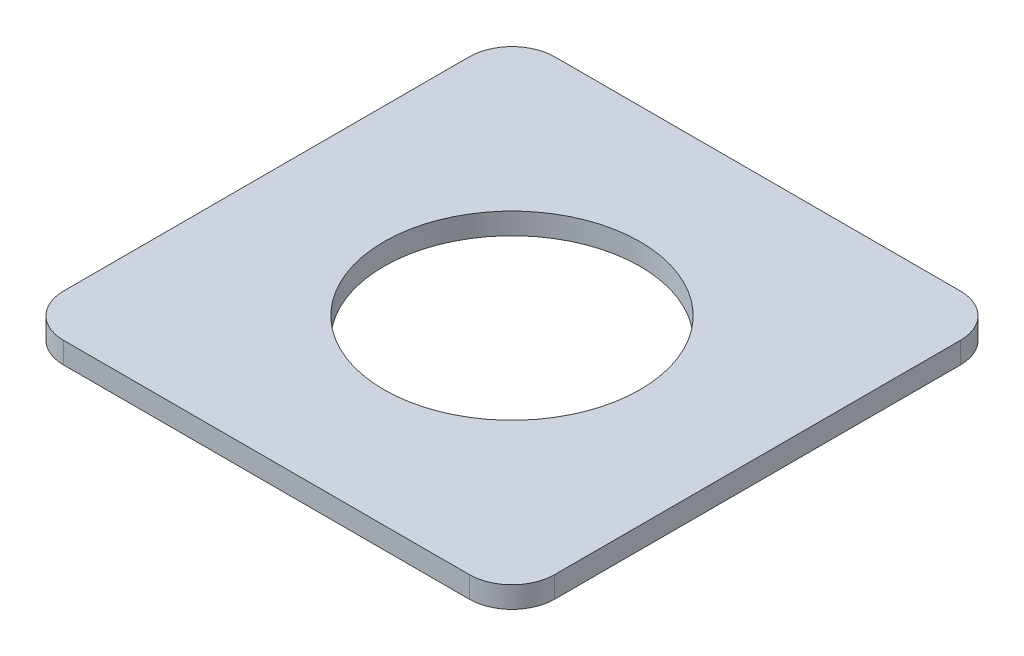
ISO-10303-21;
HEADER;
FILE_DESCRIPTION(('STEP AP214'),'2;1');
FILE_NAME('part.step','',(''),(''),'','','');
FILE_SCHEMA(('AUTOMOTIVE_DESIGN { 1 0 10303 214 1 1 1 1 }'));
ENDSEC;
DATA;
#1=APPLICATION_CONTEXT('core data for automotive mechanical design processes');
#2=APPLICATION_PROTOCOL_DEFINITION('international standard','automotive_design',2000,#1);
#3=PRODUCT_CONTEXT('',#1,'mechanical');
#4=PRODUCT('Part','Part','',(#3));
#5=PRODUCT_RELATED_PRODUCT_CATEGORY('part','',(#4));
#6=PRODUCT_DEFINITION_FORMATION('','',#4);
#7=PRODUCT_DEFINITION_CONTEXT('part definition',#1,'design');
#8=PRODUCT_DEFINITION('design','',#6,#7);
#9=PRODUCT_DEFINITION_SHAPE('','',#8);
#10=(LENGTH_UNIT() NAMED_UNIT(*) SI_UNIT(.MILLI.,.METRE.));
#11=(NAMED_UNIT(*) PLANE_ANGLE_UNIT() SI_UNIT($,.RADIAN.));
#12=(NAMED_UNIT(*) SI_UNIT($,.STERADIAN.) SOLID_ANGLE_UNIT());
#13=UNCERTAINTY_MEASURE_WITH_UNIT(LENGTH_MEASURE(1.E-05),#10,'distance_accuracy_value','');
#14=(GEOMETRIC_REPRESENTATION_CONTEXT(3) GLOBAL_UNCERTAINTY_ASSIGNED_CONTEXT((#13)) GLOBAL_UNIT_ASSIGNED_CONTEXT((#10,
#11,#12)) REPRESENTATION_CONTEXT('',''));
#15=CARTESIAN_POINT('',(0.,0.,0.));
#16=DIRECTION('',(0.,0.,1.));
#17=DIRECTION('',(1.,0.,0.));
#18=AXIS2_PLACEMENT_3D('',#15,#16,#17);
#19=CARTESIAN_POINT('',(-9.50000000000001,1.,9.5));
#20=DIRECTION('',(0.,-1.,0.));
#21=DIRECTION('',(0.,0.,-1.));
#22=AXIS2_PLACEMENT_3D('',#19,#20,#21);
#23=PLANE('',#22);
#24=CARTESIAN_POINT('',(-9.50000000000001,1.,9.5));
#25=DIRECTION('',(0.,1.,0.));
#26=DIRECTION('',(0.,0.,-1.));
#27=AXIS2_PLACEMENT_3D('',#24,#25,#26);
#28=CIRCLE('',#27,2.);
#29=CARTESIAN_POINT('',(-11.5,1.,9.5));
#30=VERTEX_POINT('',#29);
#31=CARTESIAN_POINT('',(-9.50000000000001,1.,11.5));
#32=VERTEX_POINT('',#31);
#33=EDGE_CURVE('E144',#30,#32,#28,.T.);
#34=ORIENTED_EDGE('',*,*,#33,.T.);
#35=DIRECTION('',(1.,0.,0.));
#36=VECTOR('',#35,1.);
#37=CARTESIAN_POINT('',(9.49999999999999,1.,11.5));
#38=LINE('',#37,#36);
#39=CARTESIAN_POINT('',(9.49999999999999,1.,11.5));
#40=VERTEX_POINT('',#39);
#41=EDGE_CURVE('E92',#32,#40,#38,.T.);
#42=ORIENTED_EDGE('',*,*,#41,.T.);
#43=CARTESIAN_POINT('',(9.5,1.,9.5));
#44=DIRECTION('',(0.,1.,0.));
#45=DIRECTION('',(0.,0.,1.));
#46=AXIS2_PLACEMENT_3D('',#43,#44,#45);
#47=CIRCLE('',#46,2.);
#48=CARTESIAN_POINT('',(11.5,1.,9.5));
#49=VERTEX_POINT('',#48);
#50=EDGE_CURVE('E159',#40,#49,#47,.T.);
#51=ORIENTED_EDGE('',*,*,#50,.T.);
#52=DIRECTION('',(0.,0.,-1.));
#53=VECTOR('',#52,1.);
#54=CARTESIAN_POINT('',(11.5,1.,9.5));
#55=LINE('',#54,#53);
#56=CARTESIAN_POINT('',(11.5,1.,-9.5));
#57=VERTEX_POINT('',#56);
#58=EDGE_CURVE('E172',#49,#57,#55,.T.);
#59=ORIENTED_EDGE('',*,*,#58,.T.);
#60=CARTESIAN_POINT('',(9.5,1.,-9.5));
#61=DIRECTION('',(0.,1.,0.));
#62=DIRECTION('',(0.,0.,-1.));
#63=AXIS2_PLACEMENT_3D('',#60,#61,#62);
#64=CIRCLE('',#63,2.);
#65=CARTESIAN_POINT('',(9.5,1.,-11.5));
#66=VERTEX_POINT('',#65);
#67=EDGE_CURVE('E111',#57,#66,#64,.T.);
#68=ORIENTED_EDGE('',*,*,#67,.T.);
#69=DIRECTION('',(-1.,0.,0.));
#70=VECTOR('',#69,1.);
#71=CARTESIAN_POINT('',(9.5,1.,-11.5));
#72=LINE('',#71,#70);
#73=CARTESIAN_POINT('',(-9.5,1.,-11.5));
#74=VERTEX_POINT('',#73);
#75=EDGE_CURVE('E105',#66,#74,#72,.T.);
#76=ORIENTED_EDGE('',*,*,#75,.T.);
#77=CARTESIAN_POINT('',(-9.5,1.,-9.5));
#78=DIRECTION('',(0.,1.,0.));
#79=DIRECTION('',(0.,0.,1.));
#80=AXIS2_PLACEMENT_3D('',#77,#78,#79);
#81=CIRCLE('',#80,2.);
#82=CARTESIAN_POINT('',(-11.5,1.,-9.5));
#83=VERTEX_POINT('',#82);
#84=EDGE_CURVE('E109',#74,#83,#81,.T.);
#85=ORIENTED_EDGE('',*,*,#84,.T.);
#86=DIRECTION('',(0.,0.,1.));
#87=VECTOR('',#86,1.);
#88=CARTESIAN_POINT('',(-11.5,1.,9.5));
#89=LINE('',#88,#87);
#90=EDGE_CURVE('E49',#83,#30,#89,.T.);
#91=ORIENTED_EDGE('',*,*,#90,.T.);
#92=EDGE_LOOP('',(#34,#42,#51,#59,#68,#76,#85,#91));
#93=FACE_BOUND('',#92,.T.);
#94=CARTESIAN_POINT('',(0.,1.,0.));
#95=DIRECTION('',(0.,1.,0.));
#96=DIRECTION('',(0.,0.,1.));
#97=AXIS2_PLACEMENT_3D('',#94,#95,#96);
#98=CIRCLE('',#97,6.);
#99=CARTESIAN_POINT('',(0.,1.,6.));
#100=VERTEX_POINT('',#99);
#101=EDGE_CURVE('E133',#100,#100,#98,.T.);
#102=ORIENTED_EDGE('',*,*,#101,.F.);
#103=EDGE_LOOP('',(#102));
#104=FACE_BOUND('',#103,.T.);
#105=ADVANCED_FACE('F32',(#93,#104),#23,.F.);
#106=CARTESIAN_POINT('',(-9.50000000000001,0.,9.5));
#107=DIRECTION('',(0.,-1.,0.));
#108=DIRECTION('',(0.,0.,-1.));
#109=AXIS2_PLACEMENT_3D('',#106,#107,#108);
#110=PLANE('',#109);
#111=CARTESIAN_POINT('',(-9.50000000000001,0.,9.5));
#112=DIRECTION('',(0.,1.,0.));
#113=DIRECTION('',(0.,0.,-1.));
#114=AXIS2_PLACEMENT_3D('',#111,#112,#113);
#115=CIRCLE('',#114,2.);
#116=CARTESIAN_POINT('',(-11.5,0.,9.5));
#117=VERTEX_POINT('',#116);
#118=CARTESIAN_POINT('',(-9.50000000000001,0.,11.5));
#119=VERTEX_POINT('',#118);
#120=EDGE_CURVE('E129',#117,#119,#115,.T.);
#121=ORIENTED_EDGE('',*,*,#120,.F.);
#122=DIRECTION('',(0.,0.,1.));
#123=VECTOR('',#122,1.);
#124=CARTESIAN_POINT('',(-11.5,0.,9.5));
#125=LINE('',#124,#123);
#126=CARTESIAN_POINT('',(-11.5,0.,-9.5));
#127=VERTEX_POINT('',#126);
#128=EDGE_CURVE('E84',#127,#117,#125,.T.);
#129=ORIENTED_EDGE('',*,*,#128,.F.);
#130=CARTESIAN_POINT('',(-9.5,0.,-9.5));
#131=DIRECTION('',(0.,1.,0.));
#132=DIRECTION('',(0.,0.,1.));
#133=AXIS2_PLACEMENT_3D('',#130,#131,#132);
#134=CIRCLE('',#133,2.);
#135=CARTESIAN_POINT('',(-9.5,0.,-11.5));
#136=VERTEX_POINT('',#135);
#137=EDGE_CURVE('E78',#136,#127,#134,.T.);
#138=ORIENTED_EDGE('',*,*,#137,.F.);
#139=DIRECTION('',(-1.,0.,0.));
#140=VECTOR('',#139,1.);
#141=CARTESIAN_POINT('',(9.5,0.,-11.5));
#142=LINE('',#141,#140);
#143=CARTESIAN_POINT('',(9.5,0.,-11.5));
#144=VERTEX_POINT('',#143);
#145=EDGE_CURVE('E119',#144,#136,#142,.T.);
#146=ORIENTED_EDGE('',*,*,#145,.F.);
#147=CARTESIAN_POINT('',(9.5,0.,-9.5));
#148=DIRECTION('',(0.,1.,0.));
#149=DIRECTION('',(0.,0.,-1.));
#150=AXIS2_PLACEMENT_3D('',#147,#148,#149);
#151=CIRCLE('',#150,2.);
#152=CARTESIAN_POINT('',(11.5,0.,-9.5));
#153=VERTEX_POINT('',#152);
#154=EDGE_CURVE('E139',#153,#144,#151,.T.);
#155=ORIENTED_EDGE('',*,*,#154,.F.);
#156=DIRECTION('',(0.,0.,-1.));
#157=VECTOR('',#156,1.);
#158=CARTESIAN_POINT('',(11.5,0.,9.5));
#159=LINE('',#158,#157);
#160=CARTESIAN_POINT('',(11.5,0.,9.5));
#161=VERTEX_POINT('',#160);
#162=EDGE_CURVE('E137',#161,#153,#159,.T.);
#163=ORIENTED_EDGE('',*,*,#162,.F.);
#164=CARTESIAN_POINT('',(9.5,0.,9.5));
#165=DIRECTION('',(0.,1.,0.));
#166=DIRECTION('',(0.,0.,1.));
#167=AXIS2_PLACEMENT_3D('',#164,#165,#166);
#168=CIRCLE('',#167,2.);
#169=CARTESIAN_POINT('',(9.49999999999999,0.,11.5));
#170=VERTEX_POINT('',#169);
#171=EDGE_CURVE('E135',#170,#161,#168,.T.);
#172=ORIENTED_EDGE('',*,*,#171,.F.);
#173=DIRECTION('',(1.,0.,0.));
#174=VECTOR('',#173,1.);
#175=CARTESIAN_POINT('',(9.49999999999999,0.,11.5));
#176=LINE('',#175,#174);
#177=EDGE_CURVE('E132',#119,#170,#176,.T.);
#178=ORIENTED_EDGE('',*,*,#177,.F.);
#179=EDGE_LOOP('',(#121,#129,#138,#146,#155,#163,#172,#178));
#180=FACE_BOUND('',#179,.T.);
#181=CARTESIAN_POINT('',(0.,0.,0.));
#182=DIRECTION('',(0.,1.,0.));
#183=DIRECTION('',(0.,0.,1.));
#184=AXIS2_PLACEMENT_3D('',#181,#182,#183);
#185=CIRCLE('',#184,6.);
#186=CARTESIAN_POINT('',(0.,0.,6.));
#187=VERTEX_POINT('',#186);
#188=EDGE_CURVE('E178',#187,#187,#185,.T.);
#189=ORIENTED_EDGE('',*,*,#188,.T.);
#190=EDGE_LOOP('',(#189));
#191=FACE_BOUND('',#190,.T.);
#192=ADVANCED_FACE('F163',(#180,#191),#110,.T.);
#193=CARTESIAN_POINT('',(-9.50000000000001,1.,9.5));
#194=DIRECTION('',(0.,-1.,0.));
#195=DIRECTION('',(0.,0.,-1.));
#196=AXIS2_PLACEMENT_3D('',#193,#194,#195);
#197=CYLINDRICAL_SURFACE('',#196,2.);
#198=ORIENTED_EDGE('',*,*,#120,.T.);
#199=DIRECTION('',(0.,-1.,0.));
#200=VECTOR('',#199,1.);
#201=CARTESIAN_POINT('',(-9.50000000000001,1.,11.5));
#202=LINE('',#201,#200);
#203=EDGE_CURVE('E11',#32,#119,#202,.T.);
#204=ORIENTED_EDGE('',*,*,#203,.F.);
#205=ORIENTED_EDGE('',*,*,#33,.F.);
#206=DIRECTION('',(0.,-1.,0.));
#207=VECTOR('',#206,1.);
#208=CARTESIAN_POINT('',(-11.5,1.,9.5));
#209=LINE('',#208,#207);
#210=EDGE_CURVE('E125',#30,#117,#209,.T.);
#211=ORIENTED_EDGE('',*,*,#210,.T.);
#212=EDGE_LOOP('',(#198,#204,#205,#211));
#213=FACE_BOUND('',#212,.T.);
#214=ADVANCED_FACE('F34',(#213),#197,.T.);
#215=CARTESIAN_POINT('',(9.49999999999999,1.,11.5));
#216=DIRECTION('',(0.,0.,-1.));
#217=DIRECTION('',(-1.,0.,0.));
#218=AXIS2_PLACEMENT_3D('',#215,#216,#217);
#219=PLANE('',#218);
#220=ORIENTED_EDGE('',*,*,#177,.T.);
#221=DIRECTION('',(0.,-1.,0.));
#222=VECTOR('',#221,1.);
#223=CARTESIAN_POINT('',(9.49999999999999,1.,11.5));
#224=LINE('',#223,#222);
#225=EDGE_CURVE('E41',#40,#170,#224,.T.);
#226=ORIENTED_EDGE('',*,*,#225,.F.);
#227=ORIENTED_EDGE('',*,*,#41,.F.);
#228=ORIENTED_EDGE('',*,*,#203,.T.);
#229=EDGE_LOOP('',(#220,#226,#227,#228));
#230=FACE_BOUND('',#229,.T.);
#231=ADVANCED_FACE('F206',(#230),#219,.F.);
#232=CARTESIAN_POINT('',(9.5,1.,9.5));
#233=DIRECTION('',(0.,-1.,0.));
#234=DIRECTION('',(0.,0.,-1.));
#235=AXIS2_PLACEMENT_3D('',#232,#233,#234);
#236=CYLINDRICAL_SURFACE('',#235,2.);
#237=ORIENTED_EDGE('',*,*,#171,.T.);
#238=DIRECTION('',(0.,-1.,0.));
#239=VECTOR('',#238,1.);
#240=CARTESIAN_POINT('',(11.5,1.,9.5));
#241=LINE('',#240,#239);
#242=EDGE_CURVE('E151',#49,#161,#241,.T.);
#243=ORIENTED_EDGE('',*,*,#242,.F.);
#244=ORIENTED_EDGE('',*,*,#50,.F.);
#245=ORIENTED_EDGE('',*,*,#225,.T.);
#246=EDGE_LOOP('',(#237,#243,#244,#245));
#247=FACE_BOUND('',#246,.T.);
#248=ADVANCED_FACE('F157',(#247),#236,.T.);
#249=CARTESIAN_POINT('',(11.5,1.,9.5));
#250=DIRECTION('',(-1.,0.,0.));
#251=DIRECTION('',(0.,0.,1.));
#252=AXIS2_PLACEMENT_3D('',#249,#250,#251);
#253=PLANE('',#252);
#254=ORIENTED_EDGE('',*,*,#162,.T.);
#255=DIRECTION('',(0.,-1.,0.));
#256=VECTOR('',#255,1.);
#257=CARTESIAN_POINT('',(11.5,1.,-9.5));
#258=LINE('',#257,#256);
#259=EDGE_CURVE('E148',#57,#153,#258,.T.);
#260=ORIENTED_EDGE('',*,*,#259,.F.);
#261=ORIENTED_EDGE('',*,*,#58,.F.);
#262=ORIENTED_EDGE('',*,*,#242,.T.);
#263=EDGE_LOOP('',(#254,#260,#261,#262));
#264=FACE_BOUND('',#263,.T.);
#265=ADVANCED_FACE('F168',(#264),#253,.F.);
#266=CARTESIAN_POINT('',(9.5,1.,-9.5));
#267=DIRECTION('',(0.,-1.,0.));
#268=DIRECTION('',(0.,0.,-1.));
#269=AXIS2_PLACEMENT_3D('',#266,#267,#268);
#270=CYLINDRICAL_SURFACE('',#269,2.);
#271=ORIENTED_EDGE('',*,*,#154,.T.);
#272=DIRECTION('',(0.,-1.,0.));
#273=VECTOR('',#272,1.);
#274=CARTESIAN_POINT('',(9.5,1.,-11.5));
#275=LINE('',#274,#273);
#276=EDGE_CURVE('E120',#66,#144,#275,.T.);
#277=ORIENTED_EDGE('',*,*,#276,.F.);
#278=ORIENTED_EDGE('',*,*,#67,.F.);
#279=ORIENTED_EDGE('',*,*,#259,.T.);
#280=EDGE_LOOP('',(#271,#277,#278,#279));
#281=FACE_BOUND('',#280,.T.);
#282=ADVANCED_FACE('F171',(#281),#270,.T.);
#283=CARTESIAN_POINT('',(9.5,1.,-11.5));
#284=DIRECTION('',(0.,0.,1.));
#285=DIRECTION('',(1.,0.,0.));
#286=AXIS2_PLACEMENT_3D('',#283,#284,#285);
#287=PLANE('',#286);
#288=ORIENTED_EDGE('',*,*,#145,.T.);
#289=DIRECTION('',(0.,-1.,0.));
#290=VECTOR('',#289,1.);
#291=CARTESIAN_POINT('',(-9.5,1.,-11.5));
#292=LINE('',#291,#290);
#293=EDGE_CURVE('E116',#74,#136,#292,.T.);
#294=ORIENTED_EDGE('',*,*,#293,.F.);
#295=ORIENTED_EDGE('',*,*,#75,.F.);
#296=ORIENTED_EDGE('',*,*,#276,.T.);
#297=EDGE_LOOP('',(#288,#294,#295,#296));
#298=FACE_BOUND('',#297,.T.);
#299=ADVANCED_FACE('F117',(#298),#287,.F.);
#300=CARTESIAN_POINT('',(-9.5,1.,-9.5));
#301=DIRECTION('',(0.,-1.,0.));
#302=DIRECTION('',(0.,0.,-1.));
#303=AXIS2_PLACEMENT_3D('',#300,#301,#302);
#304=CYLINDRICAL_SURFACE('',#303,2.);
#305=ORIENTED_EDGE('',*,*,#137,.T.);
#306=DIRECTION('',(0.,-1.,0.));
#307=VECTOR('',#306,1.);
#308=CARTESIAN_POINT('',(-11.5,1.,-9.5));
#309=LINE('',#308,#307);
#310=EDGE_CURVE('E121',#83,#127,#309,.T.);
#311=ORIENTED_EDGE('',*,*,#310,.F.);
#312=ORIENTED_EDGE('',*,*,#84,.F.);
#313=ORIENTED_EDGE('',*,*,#293,.T.);
#314=EDGE_LOOP('',(#305,#311,#312,#313));
#315=FACE_BOUND('',#314,.T.);
#316=ADVANCED_FACE('F123',(#315),#304,.T.);
#317=CARTESIAN_POINT('',(-11.5,1.,9.5));
#318=DIRECTION('',(1.,0.,0.));
#319=DIRECTION('',(0.,0.,-1.));
#320=AXIS2_PLACEMENT_3D('',#317,#318,#319);
#321=PLANE('',#320);
#322=ORIENTED_EDGE('',*,*,#128,.T.);
#323=ORIENTED_EDGE('',*,*,#210,.F.);
#324=ORIENTED_EDGE('',*,*,#90,.F.);
#325=ORIENTED_EDGE('',*,*,#310,.T.);
#326=EDGE_LOOP('',(#322,#323,#324,#325));
#327=FACE_BOUND('',#326,.T.);
#328=ADVANCED_FACE('F194',(#327),#321,.F.);
#329=CARTESIAN_POINT('',(0.,1.,0.));
#330=DIRECTION('',(0.,-1.,0.));
#331=DIRECTION('',(0.,0.,-1.));
#332=AXIS2_PLACEMENT_3D('',#329,#330,#331);
#333=CYLINDRICAL_SURFACE('',#332,6.);
#334=ORIENTED_EDGE('',*,*,#101,.T.);
#335=EDGE_LOOP('',(#334));
#336=FACE_BOUND('',#335,.T.);
#337=ORIENTED_EDGE('',*,*,#188,.F.);
#338=EDGE_LOOP('',(#337));
#339=FACE_BOUND('',#338,.T.);
#340=ADVANCED_FACE('F184',(#336,#339),#333,.F.);
#341=CLOSED_SHELL('',(#105,#192,#214,#231,#248,#265,#282,#299,#316,#328,#340));
#342=MANIFOLD_SOLID_BREP('B2',#341);
#343=ADVANCED_BREP_SHAPE_REPRESENTATION('',(#18,#342),#14);
#344=SHAPE_DEFINITION_REPRESENTATION(#9,#343);
ENDSEC;
END-ISO-10303-21;
